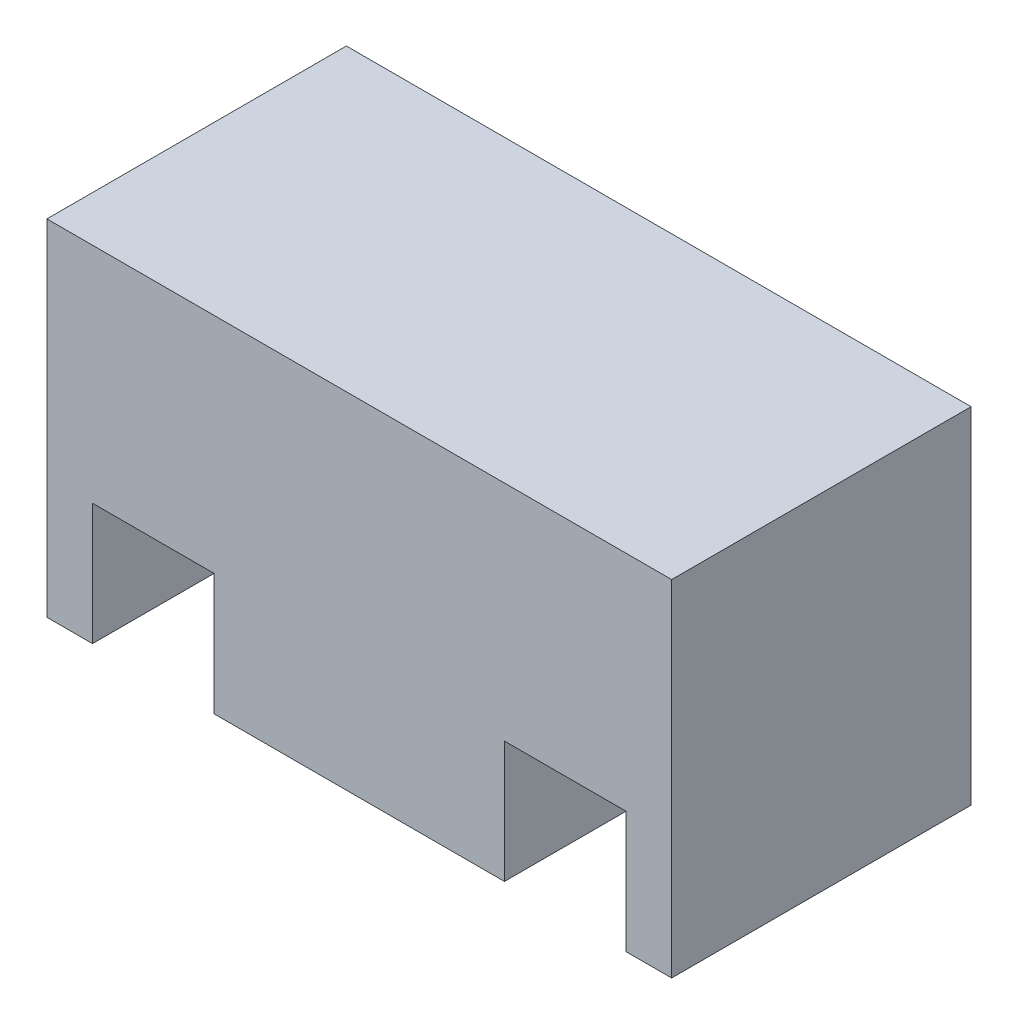
ISO-10303-21;
HEADER;
FILE_DESCRIPTION(('STEP AP214'),'2;1');
FILE_NAME('part.step','',(''),(''),'','','');
FILE_SCHEMA(('AUTOMOTIVE_DESIGN { 1 0 10303 214 1 1 1 1 }'));
ENDSEC;
DATA;
#1=APPLICATION_CONTEXT('core data for automotive mechanical design processes');
#2=APPLICATION_PROTOCOL_DEFINITION('international standard','automotive_design',2000,#1);
#3=PRODUCT_CONTEXT('',#1,'mechanical');
#4=PRODUCT('Part','Part','',(#3));
#5=PRODUCT_RELATED_PRODUCT_CATEGORY('part','',(#4));
#6=PRODUCT_DEFINITION_FORMATION('','',#4);
#7=PRODUCT_DEFINITION_CONTEXT('part definition',#1,'design');
#8=PRODUCT_DEFINITION('design','',#6,#7);
#9=PRODUCT_DEFINITION_SHAPE('','',#8);
#10=(LENGTH_UNIT() NAMED_UNIT(*) SI_UNIT(.MILLI.,.METRE.));
#11=(NAMED_UNIT(*) PLANE_ANGLE_UNIT() SI_UNIT($,.RADIAN.));
#12=(NAMED_UNIT(*) SI_UNIT($,.STERADIAN.) SOLID_ANGLE_UNIT());
#13=UNCERTAINTY_MEASURE_WITH_UNIT(LENGTH_MEASURE(1.E-05),#10,'distance_accuracy_value','');
#14=(GEOMETRIC_REPRESENTATION_CONTEXT(3) GLOBAL_UNCERTAINTY_ASSIGNED_CONTEXT((#13)) GLOBAL_UNIT_ASSIGNED_CONTEXT((#10,
#11,#12)) REPRESENTATION_CONTEXT('',''));
#15=CARTESIAN_POINT('',(0.,0.,0.));
#16=DIRECTION('',(0.,0.,1.));
#17=DIRECTION('',(1.,0.,0.));
#18=AXIS2_PLACEMENT_3D('',#15,#16,#17);
#19=CARTESIAN_POINT('',(-20.4164559898159,-9.48481026298535,19.7));
#20=DIRECTION('',(0.,1.,0.));
#21=DIRECTION('',(0.,0.,1.));
#22=AXIS2_PLACEMENT_3D('',#19,#20,#21);
#23=PLANE('',#22);
#24=DIRECTION('',(1.,0.,0.));
#25=VECTOR('',#24,1.);
#26=CARTESIAN_POINT('',(-20.4164559898159,-9.48481026298535,0.));
#27=LINE('',#26,#25);
#28=CARTESIAN_POINT('',(-20.4164559898159,-9.48481026298535,0.));
#29=VERTEX_POINT('',#28);
#30=CARTESIAN_POINT('',(-17.4164559898159,-9.48481026298535,0.));
#31=VERTEX_POINT('',#30);
#32=EDGE_CURVE('E144',#29,#31,#27,.T.);
#33=ORIENTED_EDGE('',*,*,#32,.T.);
#34=DIRECTION('',(0.,0.,1.));
#35=VECTOR('',#34,1.);
#36=CARTESIAN_POINT('',(-17.4164559898159,-9.48481026298535,0.));
#37=LINE('',#36,#35);
#38=CARTESIAN_POINT('',(-17.4164559898159,-9.48481026298535,19.7));
#39=VERTEX_POINT('',#38);
#40=EDGE_CURVE('E129',#31,#39,#37,.T.);
#41=ORIENTED_EDGE('',*,*,#40,.T.);
#42=DIRECTION('',(1.,0.,0.));
#43=VECTOR('',#42,1.);
#44=CARTESIAN_POINT('',(-20.4164559898159,-9.48481026298535,19.7));
#45=LINE('',#44,#43);
#46=CARTESIAN_POINT('',(-20.4164559898159,-9.48481026298535,19.7));
#47=VERTEX_POINT('',#46);
#48=EDGE_CURVE('E185',#47,#39,#45,.T.);
#49=ORIENTED_EDGE('',*,*,#48,.F.);
#50=DIRECTION('',(0.,0.,-1.));
#51=VECTOR('',#50,1.);
#52=CARTESIAN_POINT('',(-20.4164559898159,-9.48481026298535,19.7));
#53=LINE('',#52,#51);
#54=EDGE_CURVE('E11',#47,#29,#53,.T.);
#55=ORIENTED_EDGE('',*,*,#54,.T.);
#56=EDGE_LOOP('',(#33,#41,#49,#55));
#57=FACE_BOUND('',#56,.T.);
#58=ADVANCED_FACE('F39',(#57),#23,.F.);
#59=CARTESIAN_POINT('',(-9.41645598981592,-9.48481026298535,19.7));
#60=VERTEX_POINT('',#59);
#61=CARTESIAN_POINT('',(9.68354401018408,-9.48481026298535,19.7));
#62=VERTEX_POINT('',#61);
#63=EDGE_CURVE('E188',#60,#62,#45,.T.);
#64=ORIENTED_EDGE('',*,*,#63,.F.);
#65=DIRECTION('',(0.,0.,1.));
#66=VECTOR('',#65,1.);
#67=CARTESIAN_POINT('',(-9.41645598981592,-9.48481026298535,0.));
#68=LINE('',#67,#66);
#69=CARTESIAN_POINT('',(-9.41645598981592,-9.48481026298535,0.));
#70=VERTEX_POINT('',#69);
#71=EDGE_CURVE('E139',#70,#60,#68,.T.);
#72=ORIENTED_EDGE('',*,*,#71,.F.);
#73=CARTESIAN_POINT('',(9.68354401018408,-9.48481026298535,0.));
#74=VERTEX_POINT('',#73);
#75=EDGE_CURVE('E154',#70,#74,#27,.T.);
#76=ORIENTED_EDGE('',*,*,#75,.T.);
#77=DIRECTION('',(0.,0.,1.));
#78=VECTOR('',#77,1.);
#79=CARTESIAN_POINT('',(9.68354401018408,-9.48481026298535,0.));
#80=LINE('',#79,#78);
#81=EDGE_CURVE('E194',#74,#62,#80,.T.);
#82=ORIENTED_EDGE('',*,*,#81,.T.);
#83=EDGE_LOOP('',(#64,#72,#76,#82));
#84=FACE_BOUND('',#83,.T.);
#85=ADVANCED_FACE('F251',(#84),#23,.F.);
#86=CARTESIAN_POINT('',(-20.4164559898159,13.2151897370147,19.7));
#87=DIRECTION('',(1.,0.,0.));
#88=DIRECTION('',(0.,0.,-1.));
#89=AXIS2_PLACEMENT_3D('',#86,#87,#88);
#90=PLANE('',#89);
#91=DIRECTION('',(0.,-1.,0.));
#92=VECTOR('',#91,1.);
#93=CARTESIAN_POINT('',(-20.4164559898159,13.2151897370147,0.));
#94=LINE('',#93,#92);
#95=CARTESIAN_POINT('',(-20.4164559898159,13.2151897370147,0.));
#96=VERTEX_POINT('',#95);
#97=EDGE_CURVE('E164',#96,#29,#94,.T.);
#98=ORIENTED_EDGE('',*,*,#97,.T.);
#99=ORIENTED_EDGE('',*,*,#54,.F.);
#100=DIRECTION('',(0.,-1.,0.));
#101=VECTOR('',#100,1.);
#102=CARTESIAN_POINT('',(-20.4164559898159,13.2151897370147,19.7));
#103=LINE('',#102,#101);
#104=CARTESIAN_POINT('',(-20.4164559898159,13.2151897370147,19.7));
#105=VERTEX_POINT('',#104);
#106=EDGE_CURVE('E190',#105,#47,#103,.T.);
#107=ORIENTED_EDGE('',*,*,#106,.F.);
#108=DIRECTION('',(0.,0.,-1.));
#109=VECTOR('',#108,1.);
#110=CARTESIAN_POINT('',(-20.4164559898159,13.2151897370147,19.7));
#111=LINE('',#110,#109);
#112=EDGE_CURVE('E181',#105,#96,#111,.T.);
#113=ORIENTED_EDGE('',*,*,#112,.T.);
#114=EDGE_LOOP('',(#98,#99,#107,#113));
#115=FACE_BOUND('',#114,.T.);
#116=ADVANCED_FACE('F41',(#115),#90,.F.);
#117=CARTESIAN_POINT('',(17.6835440101841,-9.48481026298535,19.7));
#118=VERTEX_POINT('',#117);
#119=CARTESIAN_POINT('',(20.6835440101841,-9.48481026298535,19.7));
#120=VERTEX_POINT('',#119);
#121=EDGE_CURVE('E189',#118,#120,#45,.T.);
#122=ORIENTED_EDGE('',*,*,#121,.F.);
#123=DIRECTION('',(0.,0.,1.));
#124=VECTOR('',#123,1.);
#125=CARTESIAN_POINT('',(17.6835440101841,-9.48481026298535,0.));
#126=LINE('',#125,#124);
#127=CARTESIAN_POINT('',(17.6835440101841,-9.48481026298535,0.));
#128=VERTEX_POINT('',#127);
#129=EDGE_CURVE('E198',#128,#118,#126,.T.);
#130=ORIENTED_EDGE('',*,*,#129,.F.);
#131=CARTESIAN_POINT('',(20.6835440101841,-9.48481026298535,0.));
#132=VERTEX_POINT('',#131);
#133=EDGE_CURVE('E156',#128,#132,#27,.T.);
#134=ORIENTED_EDGE('',*,*,#133,.T.);
#135=DIRECTION('',(0.,0.,-1.));
#136=VECTOR('',#135,1.);
#137=CARTESIAN_POINT('',(20.6835440101841,-9.48481026298535,19.7));
#138=LINE('',#137,#136);
#139=EDGE_CURVE('E48',#120,#132,#138,.T.);
#140=ORIENTED_EDGE('',*,*,#139,.F.);
#141=EDGE_LOOP('',(#122,#130,#134,#140));
#142=FACE_BOUND('',#141,.T.);
#143=ADVANCED_FACE('F263',(#142),#23,.F.);
#144=CARTESIAN_POINT('',(20.6835440101841,13.2151897370147,19.7));
#145=DIRECTION('',(-1.,0.,0.));
#146=DIRECTION('',(0.,-1.,0.));
#147=AXIS2_PLACEMENT_3D('',#144,#145,#146);
#148=PLANE('',#147);
#149=DIRECTION('',(0.,1.,0.));
#150=VECTOR('',#149,1.);
#151=CARTESIAN_POINT('',(20.6835440101841,13.2151897370147,0.));
#152=LINE('',#151,#150);
#153=CARTESIAN_POINT('',(20.6835440101841,13.2151897370147,0.));
#154=VERTEX_POINT('',#153);
#155=EDGE_CURVE('E153',#132,#154,#152,.T.);
#156=ORIENTED_EDGE('',*,*,#155,.T.);
#157=DIRECTION('',(0.,0.,-1.));
#158=VECTOR('',#157,1.);
#159=CARTESIAN_POINT('',(20.6835440101841,13.2151897370147,19.7));
#160=LINE('',#159,#158);
#161=CARTESIAN_POINT('',(20.6835440101841,13.2151897370147,19.7));
#162=VERTEX_POINT('',#161);
#163=EDGE_CURVE('E267',#162,#154,#160,.T.);
#164=ORIENTED_EDGE('',*,*,#163,.F.);
#165=DIRECTION('',(0.,1.,0.));
#166=VECTOR('',#165,1.);
#167=CARTESIAN_POINT('',(20.6835440101841,13.2151897370147,19.7));
#168=LINE('',#167,#166);
#169=EDGE_CURVE('E182',#120,#162,#168,.T.);
#170=ORIENTED_EDGE('',*,*,#169,.F.);
#171=ORIENTED_EDGE('',*,*,#139,.T.);
#172=EDGE_LOOP('',(#156,#164,#170,#171));
#173=FACE_BOUND('',#172,.T.);
#174=ADVANCED_FACE('F268',(#173),#148,.F.);
#175=CARTESIAN_POINT('',(-20.4164559898159,13.2151897370147,19.7));
#176=DIRECTION('',(0.,-1.,0.));
#177=DIRECTION('',(0.,0.,-1.));
#178=AXIS2_PLACEMENT_3D('',#175,#176,#177);
#179=PLANE('',#178);
#180=DIRECTION('',(-1.,0.,0.));
#181=VECTOR('',#180,1.);
#182=CARTESIAN_POINT('',(-20.4164559898159,13.2151897370147,0.));
#183=LINE('',#182,#181);
#184=EDGE_CURVE('E159',#154,#96,#183,.T.);
#185=ORIENTED_EDGE('',*,*,#184,.T.);
#186=ORIENTED_EDGE('',*,*,#112,.F.);
#187=DIRECTION('',(-1.,0.,0.));
#188=VECTOR('',#187,1.);
#189=CARTESIAN_POINT('',(-20.4164559898159,13.2151897370147,19.7));
#190=LINE('',#189,#188);
#191=EDGE_CURVE('E178',#162,#105,#190,.T.);
#192=ORIENTED_EDGE('',*,*,#191,.F.);
#193=ORIENTED_EDGE('',*,*,#163,.T.);
#194=EDGE_LOOP('',(#185,#186,#192,#193));
#195=FACE_BOUND('',#194,.T.);
#196=ADVANCED_FACE('F276',(#195),#179,.F.);
#197=CARTESIAN_POINT('',(0.,0.,19.7));
#198=DIRECTION('',(0.,0.,1.));
#199=DIRECTION('',(1.,0.,0.));
#200=AXIS2_PLACEMENT_3D('',#197,#198,#199);
#201=PLANE('',#200);
#202=DIRECTION('',(0.,-1.,0.));
#203=VECTOR('',#202,1.);
#204=CARTESIAN_POINT('',(-17.4164559898159,-9.48481026298535,19.7));
#205=LINE('',#204,#203);
#206=CARTESIAN_POINT('',(-17.4164559898159,-1.48481026298535,19.7));
#207=VERTEX_POINT('',#206);
#208=EDGE_CURVE('E134',#207,#39,#205,.T.);
#209=ORIENTED_EDGE('',*,*,#208,.F.);
#210=DIRECTION('',(-1.,0.,0.));
#211=VECTOR('',#210,1.);
#212=CARTESIAN_POINT('',(-17.4164559898159,-1.48481026298535,19.7));
#213=LINE('',#212,#211);
#214=CARTESIAN_POINT('',(-9.41645598981592,-1.48481026298535,19.7));
#215=VERTEX_POINT('',#214);
#216=EDGE_CURVE('E148',#215,#207,#213,.T.);
#217=ORIENTED_EDGE('',*,*,#216,.F.);
#218=DIRECTION('',(0.,1.,0.));
#219=VECTOR('',#218,1.);
#220=CARTESIAN_POINT('',(-9.41645598981592,-9.48481026298535,19.7));
#221=LINE('',#220,#219);
#222=EDGE_CURVE('E235',#60,#215,#221,.T.);
#223=ORIENTED_EDGE('',*,*,#222,.F.);
#224=ORIENTED_EDGE('',*,*,#63,.T.);
#225=DIRECTION('',(0.,-1.,0.));
#226=VECTOR('',#225,1.);
#227=CARTESIAN_POINT('',(9.68354401018408,-9.48481026298535,19.7));
#228=LINE('',#227,#226);
#229=CARTESIAN_POINT('',(9.68354401018408,-1.48481026298535,19.7));
#230=VERTEX_POINT('',#229);
#231=EDGE_CURVE('E216',#230,#62,#228,.T.);
#232=ORIENTED_EDGE('',*,*,#231,.F.);
#233=DIRECTION('',(-1.,0.,0.));
#234=VECTOR('',#233,1.);
#235=CARTESIAN_POINT('',(9.68354401018408,-1.48481026298535,19.7));
#236=LINE('',#235,#234);
#237=CARTESIAN_POINT('',(17.6835440101841,-1.48481026298535,19.7));
#238=VERTEX_POINT('',#237);
#239=EDGE_CURVE('E207',#238,#230,#236,.T.);
#240=ORIENTED_EDGE('',*,*,#239,.F.);
#241=DIRECTION('',(0.,1.,0.));
#242=VECTOR('',#241,1.);
#243=CARTESIAN_POINT('',(17.6835440101841,-9.48481026298535,19.7));
#244=LINE('',#243,#242);
#245=EDGE_CURVE('E212',#118,#238,#244,.T.);
#246=ORIENTED_EDGE('',*,*,#245,.F.);
#247=ORIENTED_EDGE('',*,*,#121,.T.);
#248=ORIENTED_EDGE('',*,*,#169,.T.);
#249=ORIENTED_EDGE('',*,*,#191,.T.);
#250=ORIENTED_EDGE('',*,*,#106,.T.);
#251=ORIENTED_EDGE('',*,*,#48,.T.);
#252=EDGE_LOOP('',(#209,#217,#223,#224,#232,#240,#246,#247,#248,#249,#250,#251));
#253=FACE_BOUND('',#252,.T.);
#254=ADVANCED_FACE('F259',(#253),#201,.T.);
#255=CARTESIAN_POINT('',(0.,0.,0.));
#256=DIRECTION('',(0.,0.,1.));
#257=DIRECTION('',(1.,0.,0.));
#258=AXIS2_PLACEMENT_3D('',#255,#256,#257);
#259=PLANE('',#258);
#260=DIRECTION('',(-1.,0.,0.));
#261=VECTOR('',#260,1.);
#262=CARTESIAN_POINT('',(-17.4164559898159,-1.48481026298535,0.));
#263=LINE('',#262,#261);
#264=CARTESIAN_POINT('',(-9.41645598981592,-1.48481026298535,0.));
#265=VERTEX_POINT('',#264);
#266=CARTESIAN_POINT('',(-17.4164559898159,-1.48481026298535,0.));
#267=VERTEX_POINT('',#266);
#268=EDGE_CURVE('E55',#265,#267,#263,.T.);
#269=ORIENTED_EDGE('',*,*,#268,.T.);
#270=DIRECTION('',(0.,-1.,0.));
#271=VECTOR('',#270,1.);
#272=CARTESIAN_POINT('',(-17.4164559898159,-9.48481026298535,0.));
#273=LINE('',#272,#271);
#274=EDGE_CURVE('E132',#267,#31,#273,.T.);
#275=ORIENTED_EDGE('',*,*,#274,.T.);
#276=ORIENTED_EDGE('',*,*,#32,.F.);
#277=ORIENTED_EDGE('',*,*,#97,.F.);
#278=ORIENTED_EDGE('',*,*,#184,.F.);
#279=ORIENTED_EDGE('',*,*,#155,.F.);
#280=ORIENTED_EDGE('',*,*,#133,.F.);
#281=DIRECTION('',(0.,1.,0.));
#282=VECTOR('',#281,1.);
#283=CARTESIAN_POINT('',(17.6835440101841,-9.48481026298535,0.));
#284=LINE('',#283,#282);
#285=CARTESIAN_POINT('',(17.6835440101841,-1.48481026298535,0.));
#286=VERTEX_POINT('',#285);
#287=EDGE_CURVE('E221',#128,#286,#284,.T.);
#288=ORIENTED_EDGE('',*,*,#287,.T.);
#289=DIRECTION('',(-1.,0.,0.));
#290=VECTOR('',#289,1.);
#291=CARTESIAN_POINT('',(9.68354401018408,-1.48481026298535,0.));
#292=LINE('',#291,#290);
#293=CARTESIAN_POINT('',(9.68354401018408,-1.48481026298535,0.));
#294=VERTEX_POINT('',#293);
#295=EDGE_CURVE('E63',#286,#294,#292,.T.);
#296=ORIENTED_EDGE('',*,*,#295,.T.);
#297=DIRECTION('',(0.,-1.,0.));
#298=VECTOR('',#297,1.);
#299=CARTESIAN_POINT('',(9.68354401018408,-9.48481026298535,0.));
#300=LINE('',#299,#298);
#301=EDGE_CURVE('E211',#294,#74,#300,.T.);
#302=ORIENTED_EDGE('',*,*,#301,.T.);
#303=ORIENTED_EDGE('',*,*,#75,.F.);
#304=DIRECTION('',(0.,1.,0.));
#305=VECTOR('',#304,1.);
#306=CARTESIAN_POINT('',(-9.41645598981592,-9.48481026298535,0.));
#307=LINE('',#306,#305);
#308=EDGE_CURVE('E147',#70,#265,#307,.T.);
#309=ORIENTED_EDGE('',*,*,#308,.T.);
#310=EDGE_LOOP('',(#269,#275,#276,#277,#278,#279,#280,#288,#296,#302,#303,#309));
#311=FACE_BOUND('',#310,.T.);
#312=ADVANCED_FACE('F142',(#311),#259,.F.);
#313=CARTESIAN_POINT('',(9.68354401018408,-9.48481026298535,0.));
#314=DIRECTION('',(-1.,0.,0.));
#315=DIRECTION('',(0.,0.,1.));
#316=AXIS2_PLACEMENT_3D('',#313,#314,#315);
#317=PLANE('',#316);
#318=ORIENTED_EDGE('',*,*,#231,.T.);
#319=ORIENTED_EDGE('',*,*,#81,.F.);
#320=ORIENTED_EDGE('',*,*,#301,.F.);
#321=DIRECTION('',(0.,0.,1.));
#322=VECTOR('',#321,1.);
#323=CARTESIAN_POINT('',(9.68354401018408,-1.48481026298535,0.));
#324=LINE('',#323,#322);
#325=EDGE_CURVE('E204',#294,#230,#324,.T.);
#326=ORIENTED_EDGE('',*,*,#325,.T.);
#327=EDGE_LOOP('',(#318,#319,#320,#326));
#328=FACE_BOUND('',#327,.T.);
#329=ADVANCED_FACE('F293',(#328),#317,.F.);
#330=CARTESIAN_POINT('',(9.68354401018408,-1.48481026298535,0.));
#331=DIRECTION('',(0.,1.,0.));
#332=DIRECTION('',(0.,0.,1.));
#333=AXIS2_PLACEMENT_3D('',#330,#331,#332);
#334=PLANE('',#333);
#335=ORIENTED_EDGE('',*,*,#239,.T.);
#336=ORIENTED_EDGE('',*,*,#325,.F.);
#337=ORIENTED_EDGE('',*,*,#295,.F.);
#338=DIRECTION('',(0.,0.,1.));
#339=VECTOR('',#338,1.);
#340=CARTESIAN_POINT('',(17.6835440101841,-1.48481026298535,0.));
#341=LINE('',#340,#339);
#342=EDGE_CURVE('E201',#286,#238,#341,.T.);
#343=ORIENTED_EDGE('',*,*,#342,.T.);
#344=EDGE_LOOP('',(#335,#336,#337,#343));
#345=FACE_BOUND('',#344,.T.);
#346=ADVANCED_FACE('F298',(#345),#334,.F.);
#347=CARTESIAN_POINT('',(17.6835440101841,-9.48481026298535,0.));
#348=DIRECTION('',(1.,0.,0.));
#349=DIRECTION('',(0.,0.,-1.));
#350=AXIS2_PLACEMENT_3D('',#347,#348,#349);
#351=PLANE('',#350);
#352=ORIENTED_EDGE('',*,*,#245,.T.);
#353=ORIENTED_EDGE('',*,*,#342,.F.);
#354=ORIENTED_EDGE('',*,*,#287,.F.);
#355=ORIENTED_EDGE('',*,*,#129,.T.);
#356=EDGE_LOOP('',(#352,#353,#354,#355));
#357=FACE_BOUND('',#356,.T.);
#358=ADVANCED_FACE('F300',(#357),#351,.F.);
#359=CARTESIAN_POINT('',(-17.4164559898159,-9.48481026298535,0.));
#360=DIRECTION('',(-1.,0.,0.));
#361=DIRECTION('',(0.,0.,1.));
#362=AXIS2_PLACEMENT_3D('',#359,#360,#361);
#363=PLANE('',#362);
#364=ORIENTED_EDGE('',*,*,#208,.T.);
#365=ORIENTED_EDGE('',*,*,#40,.F.);
#366=ORIENTED_EDGE('',*,*,#274,.F.);
#367=DIRECTION('',(0.,0.,1.));
#368=VECTOR('',#367,1.);
#369=CARTESIAN_POINT('',(-17.4164559898159,-1.48481026298535,0.));
#370=LINE('',#369,#368);
#371=EDGE_CURVE('E171',#267,#207,#370,.T.);
#372=ORIENTED_EDGE('',*,*,#371,.T.);
#373=EDGE_LOOP('',(#364,#365,#366,#372));
#374=FACE_BOUND('',#373,.T.);
#375=ADVANCED_FACE('F131',(#374),#363,.F.);
#376=CARTESIAN_POINT('',(-17.4164559898159,-1.48481026298535,0.));
#377=DIRECTION('',(0.,1.,0.));
#378=DIRECTION('',(0.,0.,1.));
#379=AXIS2_PLACEMENT_3D('',#376,#377,#378);
#380=PLANE('',#379);
#381=ORIENTED_EDGE('',*,*,#216,.T.);
#382=ORIENTED_EDGE('',*,*,#371,.F.);
#383=ORIENTED_EDGE('',*,*,#268,.F.);
#384=DIRECTION('',(0.,0.,1.));
#385=VECTOR('',#384,1.);
#386=CARTESIAN_POINT('',(-9.41645598981592,-1.48481026298535,0.));
#387=LINE('',#386,#385);
#388=EDGE_CURVE('E175',#265,#215,#387,.T.);
#389=ORIENTED_EDGE('',*,*,#388,.T.);
#390=EDGE_LOOP('',(#381,#382,#383,#389));
#391=FACE_BOUND('',#390,.T.);
#392=ADVANCED_FACE('F308',(#391),#380,.F.);
#393=CARTESIAN_POINT('',(-9.41645598981592,-9.48481026298535,0.));
#394=DIRECTION('',(1.,0.,0.));
#395=DIRECTION('',(0.,0.,-1.));
#396=AXIS2_PLACEMENT_3D('',#393,#394,#395);
#397=PLANE('',#396);
#398=ORIENTED_EDGE('',*,*,#222,.T.);
#399=ORIENTED_EDGE('',*,*,#388,.F.);
#400=ORIENTED_EDGE('',*,*,#308,.F.);
#401=ORIENTED_EDGE('',*,*,#71,.T.);
#402=EDGE_LOOP('',(#398,#399,#400,#401));
#403=FACE_BOUND('',#402,.T.);
#404=ADVANCED_FACE('F247',(#403),#397,.F.);
#405=CLOSED_SHELL('',(#58,#85,#116,#143,#174,#196,#254,#312,#329,#346,#358,#375,#392,#404));
#406=MANIFOLD_SOLID_BREP('B2',#405);
#407=ADVANCED_BREP_SHAPE_REPRESENTATION('',(#18,#406),#14);
#408=SHAPE_DEFINITION_REPRESENTATION(#9,#407);
ENDSEC;
END-ISO-10303-21;
